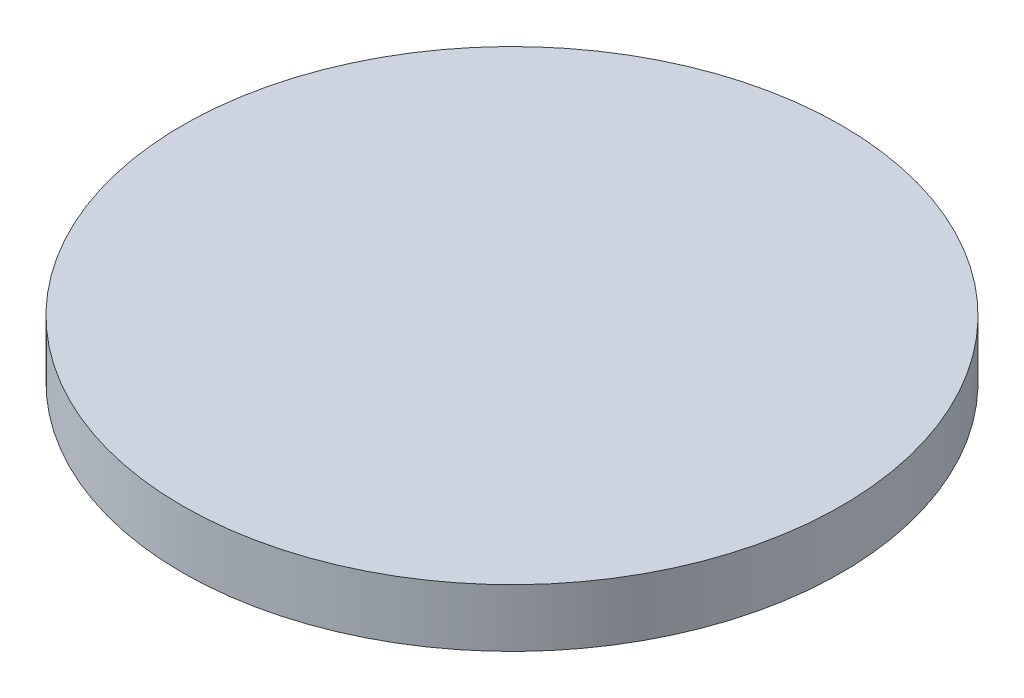
ISO-10303-21;
HEADER;
FILE_DESCRIPTION(('STEP AP214'),'2;1');
FILE_NAME('part.step','',(''),(''),'','','');
FILE_SCHEMA(('AUTOMOTIVE_DESIGN { 1 0 10303 214 1 1 1 1 }'));
ENDSEC;
DATA;
#1=APPLICATION_CONTEXT('core data for automotive mechanical design processes');
#2=APPLICATION_PROTOCOL_DEFINITION('international standard','automotive_design',2000,#1);
#3=PRODUCT_CONTEXT('',#1,'mechanical');
#4=PRODUCT('Part','Part','',(#3));
#5=PRODUCT_RELATED_PRODUCT_CATEGORY('part','',(#4));
#6=PRODUCT_DEFINITION_FORMATION('','',#4);
#7=PRODUCT_DEFINITION_CONTEXT('part definition',#1,'design');
#8=PRODUCT_DEFINITION('design','',#6,#7);
#9=PRODUCT_DEFINITION_SHAPE('','',#8);
#10=(LENGTH_UNIT() NAMED_UNIT(*) SI_UNIT(.MILLI.,.METRE.));
#11=(NAMED_UNIT(*) PLANE_ANGLE_UNIT() SI_UNIT($,.RADIAN.));
#12=(NAMED_UNIT(*) SI_UNIT($,.STERADIAN.) SOLID_ANGLE_UNIT());
#13=UNCERTAINTY_MEASURE_WITH_UNIT(LENGTH_MEASURE(1.E-05),#10,'distance_accuracy_value','');
#14=(GEOMETRIC_REPRESENTATION_CONTEXT(3) GLOBAL_UNCERTAINTY_ASSIGNED_CONTEXT((#13)) GLOBAL_UNIT_ASSIGNED_CONTEXT((#10,
#11,#12)) REPRESENTATION_CONTEXT('',''));
#15=CARTESIAN_POINT('',(0.,0.,0.));
#16=DIRECTION('',(0.,0.,1.));
#17=DIRECTION('',(1.,0.,0.));
#18=AXIS2_PLACEMENT_3D('',#15,#16,#17);
#19=CARTESIAN_POINT('',(0.,6.35,0.));
#20=DIRECTION('',(0.,-1.,0.));
#21=DIRECTION('',(0.,0.,-1.));
#22=AXIS2_PLACEMENT_3D('',#19,#20,#21);
#23=CYLINDRICAL_SURFACE('',#22,36.195);
#24=CARTESIAN_POINT('',(0.,6.35,0.));
#25=DIRECTION('',(0.,1.,0.));
#26=DIRECTION('',(0.,0.,1.));
#27=AXIS2_PLACEMENT_3D('',#24,#25,#26);
#28=CIRCLE('',#27,36.195);
#29=CARTESIAN_POINT('',(0.,6.35,36.195));
#30=VERTEX_POINT('',#29);
#31=EDGE_CURVE('E10',#30,#30,#28,.T.);
#32=ORIENTED_EDGE('',*,*,#31,.F.);
#33=EDGE_LOOP('',(#32));
#34=FACE_BOUND('',#33,.T.);
#35=CARTESIAN_POINT('',(0.,0.,0.));
#36=DIRECTION('',(0.,1.,0.));
#37=DIRECTION('',(0.,0.,1.));
#38=AXIS2_PLACEMENT_3D('',#35,#36,#37);
#39=CIRCLE('',#38,36.195);
#40=CARTESIAN_POINT('',(0.,0.,36.195));
#41=VERTEX_POINT('',#40);
#42=EDGE_CURVE('E44',#41,#41,#39,.T.);
#43=ORIENTED_EDGE('',*,*,#42,.T.);
#44=EDGE_LOOP('',(#43));
#45=FACE_BOUND('',#44,.T.);
#46=ADVANCED_FACE('F41',(#34,#45),#23,.T.);
#47=CARTESIAN_POINT('',(0.,6.35,0.));
#48=DIRECTION('',(0.,1.,0.));
#49=DIRECTION('',(0.,0.,1.));
#50=AXIS2_PLACEMENT_3D('',#47,#48,#49);
#51=PLANE('',#50);
#52=ORIENTED_EDGE('',*,*,#31,.T.);
#53=EDGE_LOOP('',(#52));
#54=FACE_BOUND('',#53,.T.);
#55=ADVANCED_FACE('F56',(#54),#51,.T.);
#56=CARTESIAN_POINT('',(0.,0.,0.));
#57=DIRECTION('',(0.,1.,0.));
#58=DIRECTION('',(0.,0.,1.));
#59=AXIS2_PLACEMENT_3D('',#56,#57,#58);
#60=PLANE('',#59);
#61=ORIENTED_EDGE('',*,*,#42,.F.);
#62=EDGE_LOOP('',(#61));
#63=FACE_BOUND('',#62,.T.);
#64=ADVANCED_FACE('F54',(#63),#60,.F.);
#65=CLOSED_SHELL('',(#46,#55,#64));
#66=MANIFOLD_SOLID_BREP('B2',#65);
#67=ADVANCED_BREP_SHAPE_REPRESENTATION('',(#18,#66),#14);
#68=SHAPE_DEFINITION_REPRESENTATION(#9,#67);
ENDSEC;
END-ISO-10303-21;
